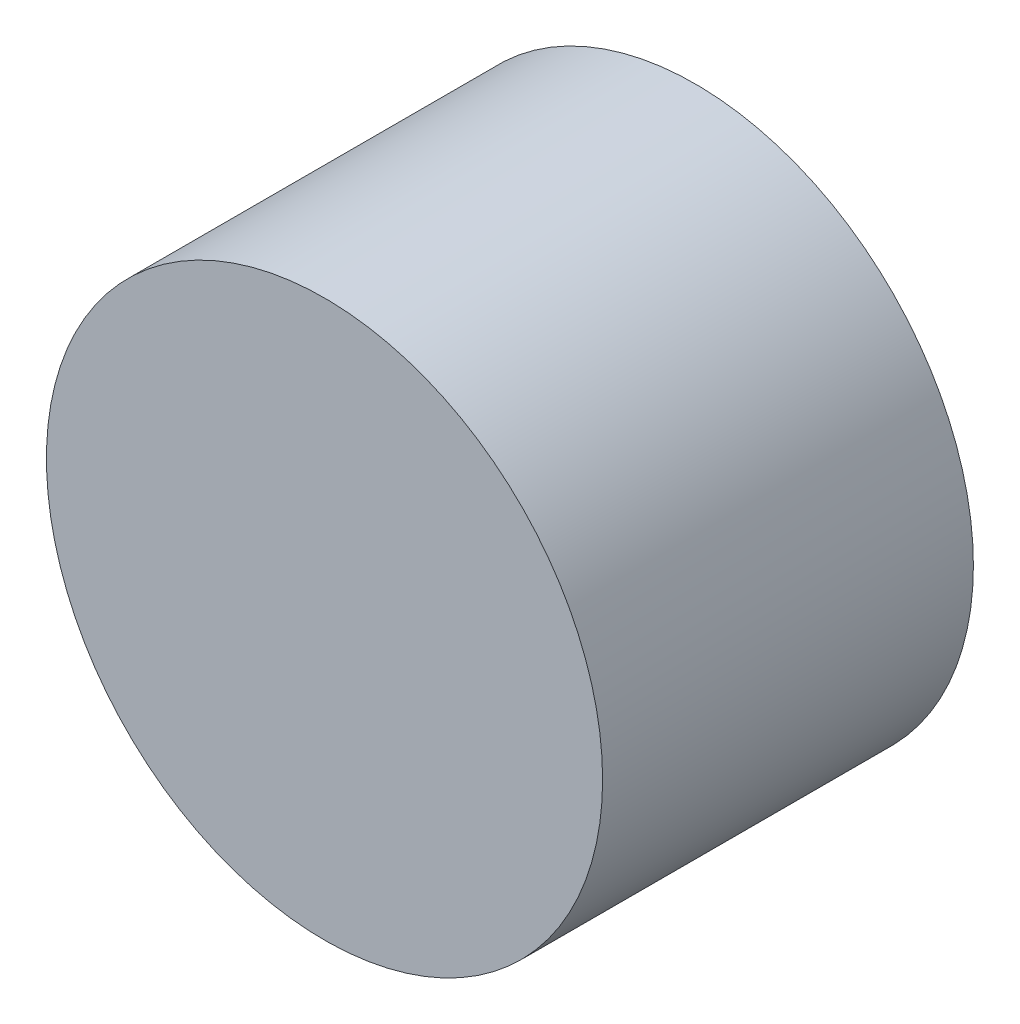
ISO-10303-21;
HEADER;
FILE_DESCRIPTION(('STEP AP214'),'2;1');
FILE_NAME('part.step','',(''),(''),'','','');
FILE_SCHEMA(('AUTOMOTIVE_DESIGN { 1 0 10303 214 1 1 1 1 }'));
ENDSEC;
DATA;
#1=APPLICATION_CONTEXT('core data for automotive mechanical design processes');
#2=APPLICATION_PROTOCOL_DEFINITION('international standard','automotive_design',2000,#1);
#3=PRODUCT_CONTEXT('',#1,'mechanical');
#4=PRODUCT('Part','Part','',(#3));
#5=PRODUCT_RELATED_PRODUCT_CATEGORY('part','',(#4));
#6=PRODUCT_DEFINITION_FORMATION('','',#4);
#7=PRODUCT_DEFINITION_CONTEXT('part definition',#1,'design');
#8=PRODUCT_DEFINITION('design','',#6,#7);
#9=PRODUCT_DEFINITION_SHAPE('','',#8);
#10=(LENGTH_UNIT() NAMED_UNIT(*) SI_UNIT(.MILLI.,.METRE.));
#11=(NAMED_UNIT(*) PLANE_ANGLE_UNIT() SI_UNIT($,.RADIAN.));
#12=(NAMED_UNIT(*) SI_UNIT($,.STERADIAN.) SOLID_ANGLE_UNIT());
#13=UNCERTAINTY_MEASURE_WITH_UNIT(LENGTH_MEASURE(1.E-05),#10,'distance_accuracy_value','');
#14=(GEOMETRIC_REPRESENTATION_CONTEXT(3) GLOBAL_UNCERTAINTY_ASSIGNED_CONTEXT((#13)) GLOBAL_UNIT_ASSIGNED_CONTEXT((#10,
#11,#12)) REPRESENTATION_CONTEXT('',''));
#15=CARTESIAN_POINT('',(0.,0.,0.));
#16=DIRECTION('',(0.,0.,1.));
#17=DIRECTION('',(1.,0.,0.));
#18=AXIS2_PLACEMENT_3D('',#15,#16,#17);
#19=CARTESIAN_POINT('',(0.,0.,2.));
#20=DIRECTION('',(0.,0.,-1.));
#21=DIRECTION('',(-1.,0.,0.));
#22=AXIS2_PLACEMENT_3D('',#19,#20,#21);
#23=CYLINDRICAL_SURFACE('',#22,1.5);
#24=CARTESIAN_POINT('',(0.,0.,2.));
#25=DIRECTION('',(0.,0.,1.));
#26=DIRECTION('',(1.,0.,0.));
#27=AXIS2_PLACEMENT_3D('',#24,#25,#26);
#28=CIRCLE('',#27,1.5);
#29=CARTESIAN_POINT('',(1.5,0.,2.));
#30=VERTEX_POINT('',#29);
#31=EDGE_CURVE('E10',#30,#30,#28,.T.);
#32=ORIENTED_EDGE('',*,*,#31,.F.);
#33=EDGE_LOOP('',(#32));
#34=FACE_BOUND('',#33,.T.);
#35=CARTESIAN_POINT('',(0.,0.,0.));
#36=DIRECTION('',(0.,0.,1.));
#37=DIRECTION('',(1.,0.,0.));
#38=AXIS2_PLACEMENT_3D('',#35,#36,#37);
#39=CIRCLE('',#38,1.5);
#40=CARTESIAN_POINT('',(1.5,0.,0.));
#41=VERTEX_POINT('',#40);
#42=EDGE_CURVE('E40',#41,#41,#39,.T.);
#43=ORIENTED_EDGE('',*,*,#42,.T.);
#44=EDGE_LOOP('',(#43));
#45=FACE_BOUND('',#44,.T.);
#46=ADVANCED_FACE('F37',(#34,#45),#23,.T.);
#47=CARTESIAN_POINT('',(0.,0.,2.));
#48=DIRECTION('',(0.,0.,1.));
#49=DIRECTION('',(1.,0.,0.));
#50=AXIS2_PLACEMENT_3D('',#47,#48,#49);
#51=PLANE('',#50);
#52=ORIENTED_EDGE('',*,*,#31,.T.);
#53=EDGE_LOOP('',(#52));
#54=FACE_BOUND('',#53,.T.);
#55=ADVANCED_FACE('F54',(#54),#51,.T.);
#56=CARTESIAN_POINT('',(0.,0.,0.));
#57=DIRECTION('',(0.,0.,1.));
#58=DIRECTION('',(1.,0.,0.));
#59=AXIS2_PLACEMENT_3D('',#56,#57,#58);
#60=PLANE('',#59);
#61=ORIENTED_EDGE('',*,*,#42,.F.);
#62=EDGE_LOOP('',(#61));
#63=FACE_BOUND('',#62,.T.);
#64=ADVANCED_FACE('F52',(#63),#60,.F.);
#65=CLOSED_SHELL('',(#46,#55,#64));
#66=MANIFOLD_SOLID_BREP('B2',#65);
#67=ADVANCED_BREP_SHAPE_REPRESENTATION('',(#18,#66),#14);
#68=SHAPE_DEFINITION_REPRESENTATION(#9,#67);
ENDSEC;
END-ISO-10303-21;
